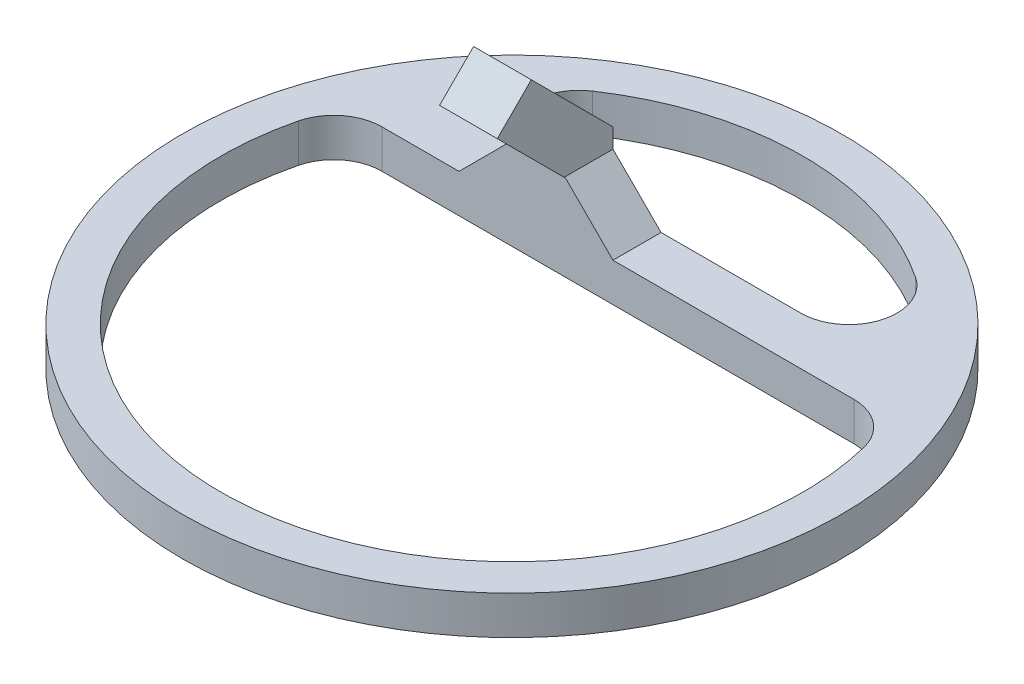
ISO-10303-21;
HEADER;
FILE_DESCRIPTION(('STEP AP214'),'2;1');
FILE_NAME('part.step','',(''),(''),'','','');
FILE_SCHEMA(('AUTOMOTIVE_DESIGN { 1 0 10303 214 1 1 1 1 }'));
ENDSEC;
DATA;
#1=APPLICATION_CONTEXT('core data for automotive mechanical design processes');
#2=APPLICATION_PROTOCOL_DEFINITION('international standard','automotive_design',2000,#1);
#3=PRODUCT_CONTEXT('',#1,'mechanical');
#4=PRODUCT('Part','Part','',(#3));
#5=PRODUCT_RELATED_PRODUCT_CATEGORY('part','',(#4));
#6=PRODUCT_DEFINITION_FORMATION('','',#4);
#7=PRODUCT_DEFINITION_CONTEXT('part definition',#1,'design');
#8=PRODUCT_DEFINITION('design','',#6,#7);
#9=PRODUCT_DEFINITION_SHAPE('','',#8);
#10=(LENGTH_UNIT() NAMED_UNIT(*) SI_UNIT(.MILLI.,.METRE.));
#11=(NAMED_UNIT(*) PLANE_ANGLE_UNIT() SI_UNIT($,.RADIAN.));
#12=(NAMED_UNIT(*) SI_UNIT($,.STERADIAN.) SOLID_ANGLE_UNIT());
#13=UNCERTAINTY_MEASURE_WITH_UNIT(LENGTH_MEASURE(1.E-05),#10,'distance_accuracy_value','');
#14=(GEOMETRIC_REPRESENTATION_CONTEXT(3) GLOBAL_UNCERTAINTY_ASSIGNED_CONTEXT((#13)) GLOBAL_UNIT_ASSIGNED_CONTEXT((#10,
#11,#12)) REPRESENTATION_CONTEXT('',''));
#15=CARTESIAN_POINT('',(0.,0.,0.));
#16=DIRECTION('',(0.,0.,1.));
#17=DIRECTION('',(1.,0.,0.));
#18=AXIS2_PLACEMENT_3D('',#15,#16,#17);
#19=CARTESIAN_POINT('',(0.,4.,0.));
#20=DIRECTION('',(0.,1.,0.));
#21=DIRECTION('',(0.,0.,1.));
#22=AXIS2_PLACEMENT_3D('',#19,#20,#21);
#23=PLANE('',#22);
#24=CARTESIAN_POINT('',(0.,4.,0.));
#25=DIRECTION('',(0.,1.,0.));
#26=DIRECTION('',(0.,0.,1.));
#27=AXIS2_PLACEMENT_3D('',#24,#25,#26);
#28=CIRCLE('',#27,34.25);
#29=CARTESIAN_POINT('',(0.,4.,34.25));
#30=VERTEX_POINT('',#29);
#31=EDGE_CURVE('E223',#30,#30,#28,.T.);
#32=ORIENTED_EDGE('',*,*,#31,.T.);
#33=EDGE_LOOP('',(#32));
#34=FACE_BOUND('',#33,.T.);
#35=DIRECTION('',(-1.,0.,0.));
#36=VECTOR('',#35,1.);
#37=CARTESIAN_POINT('',(28.1791146063889,4.,-11.));
#38=LINE('',#37,#36);
#39=CARTESIAN_POINT('',(-16.5,4.,-11.));
#40=VERTEX_POINT('',#39);
#41=CARTESIAN_POINT('',(-24.5267710879357,4.,-11.));
#42=VERTEX_POINT('',#41);
#43=EDGE_CURVE('E190',#40,#42,#38,.T.);
#44=ORIENTED_EDGE('',*,*,#43,.F.);
#45=DIRECTION('',(0.,0.,-1.));
#46=VECTOR('',#45,1.);
#47=CARTESIAN_POINT('',(-16.5,4.,0.));
#48=LINE('',#47,#46);
#49=CARTESIAN_POINT('',(-16.5,4.,-16.6583446172308));
#50=VERTEX_POINT('',#49);
#51=EDGE_CURVE('E60',#40,#50,#48,.T.);
#52=ORIENTED_EDGE('',*,*,#51,.T.);
#53=CARTESIAN_POINT('',(-14.02007489281,4.,-21.));
#54=DIRECTION('',(0.,1.,0.));
#55=DIRECTION('',(0.,0.,1.));
#56=AXIS2_PLACEMENT_3D('',#53,#54,#55);
#57=CIRCLE('',#56,5.);
#58=CARTESIAN_POINT('',(-16.7963273468317,4.,-25.1584158415841));
#59=VERTEX_POINT('',#58);
#60=EDGE_CURVE('E304',#50,#59,#57,.F.);
#61=ORIENTED_EDGE('',*,*,#60,.T.);
#62=CARTESIAN_POINT('',(0.,4.,0.));
#63=DIRECTION('',(0.,1.,0.));
#64=DIRECTION('',(0.,0.,1.));
#65=AXIS2_PLACEMENT_3D('',#62,#63,#64);
#66=CIRCLE('',#65,30.25);
#67=CARTESIAN_POINT('',(16.7963273468317,4.,-25.1584158415841));
#68=VERTEX_POINT('',#67);
#69=EDGE_CURVE('E219',#68,#59,#66,.T.);
#70=ORIENTED_EDGE('',*,*,#69,.F.);
#71=CARTESIAN_POINT('',(14.02007489281,4.,-21.));
#72=DIRECTION('',(0.,1.,0.));
#73=DIRECTION('',(0.,0.,1.));
#74=AXIS2_PLACEMENT_3D('',#71,#72,#73);
#75=CIRCLE('',#74,5.);
#76=CARTESIAN_POINT('',(14.02007489281,4.,-16.));
#77=VERTEX_POINT('',#76);
#78=EDGE_CURVE('E289',#68,#77,#75,.F.);
#79=ORIENTED_EDGE('',*,*,#78,.T.);
#80=DIRECTION('',(1.,0.,0.));
#81=VECTOR('',#80,1.);
#82=CARTESIAN_POINT('',(25.6722126042926,4.,-16.));
#83=LINE('',#82,#81);
#84=CARTESIAN_POINT('',(-0.500000000000021,4.,-16.));
#85=VERTEX_POINT('',#84);
#86=EDGE_CURVE('E209',#85,#77,#83,.T.);
#87=ORIENTED_EDGE('',*,*,#86,.F.);
#88=DIRECTION('',(0.,0.,1.));
#89=VECTOR('',#88,1.);
#90=CARTESIAN_POINT('',(-0.500000000000022,4.,-11.));
#91=LINE('',#90,#89);
#92=CARTESIAN_POINT('',(-0.500000000000021,4.,-11.));
#93=VERTEX_POINT('',#92);
#94=EDGE_CURVE('E227',#85,#93,#91,.T.);
#95=ORIENTED_EDGE('',*,*,#94,.T.);
#96=CARTESIAN_POINT('',(24.5267710879357,4.,-11.));
#97=VERTEX_POINT('',#96);
#98=EDGE_CURVE('E196',#97,#93,#38,.T.);
#99=ORIENTED_EDGE('',*,*,#98,.F.);
#100=CARTESIAN_POINT('',(24.5267710879357,4.,-6.00000000000001));
#101=DIRECTION('',(0.,1.,0.));
#102=DIRECTION('',(0.,0.,1.));
#103=AXIS2_PLACEMENT_3D('',#100,#101,#102);
#104=CIRCLE('',#103,5.);
#105=CARTESIAN_POINT('',(29.3835574419824,4.,-7.1881188118812));
#106=VERTEX_POINT('',#105);
#107=EDGE_CURVE('E295',#97,#106,#104,.F.);
#108=ORIENTED_EDGE('',*,*,#107,.T.);
#109=CARTESIAN_POINT('',(-29.3835574419824,4.,-7.1881188118812));
#110=VERTEX_POINT('',#109);
#111=EDGE_CURVE('E216',#110,#106,#66,.T.);
#112=ORIENTED_EDGE('',*,*,#111,.F.);
#113=CARTESIAN_POINT('',(-24.5267710879357,4.,-6.00000000000001));
#114=DIRECTION('',(0.,1.,0.));
#115=DIRECTION('',(0.,0.,1.));
#116=AXIS2_PLACEMENT_3D('',#113,#114,#115);
#117=CIRCLE('',#116,5.);
#118=EDGE_CURVE('E53',#110,#42,#117,.F.);
#119=ORIENTED_EDGE('',*,*,#118,.T.);
#120=EDGE_LOOP('',(#44,#52,#61,#70,#79,#87,#95,#99,#108,#112,#119));
#121=FACE_BOUND('',#120,.T.);
#122=ADVANCED_FACE('F44',(#34,#121),#23,.T.);
#123=CARTESIAN_POINT('',(0.,4.,0.));
#124=DIRECTION('',(0.,-1.,0.));
#125=DIRECTION('',(0.,0.,-1.));
#126=AXIS2_PLACEMENT_3D('',#123,#124,#125);
#127=CYLINDRICAL_SURFACE('',#126,30.25);
#128=CARTESIAN_POINT('',(0.,0.,0.));
#129=DIRECTION('',(0.,1.,0.));
#130=DIRECTION('',(0.,0.,1.));
#131=AXIS2_PLACEMENT_3D('',#128,#129,#130);
#132=CIRCLE('',#131,30.25);
#133=CARTESIAN_POINT('',(16.7963273468317,0.,-25.1584158415841));
#134=VERTEX_POINT('',#133);
#135=CARTESIAN_POINT('',(-16.7963273468317,0.,-25.1584158415841));
#136=VERTEX_POINT('',#135);
#137=EDGE_CURVE('E220',#134,#136,#132,.T.);
#138=ORIENTED_EDGE('',*,*,#137,.F.);
#139=DIRECTION('',(0.,-1.,0.));
#140=VECTOR('',#139,1.);
#141=CARTESIAN_POINT('',(16.7963273468317,4.,-25.1584158415842));
#142=LINE('',#141,#140);
#143=EDGE_CURVE('E265',#134,#68,#142,.F.);
#144=ORIENTED_EDGE('',*,*,#143,.T.);
#145=ORIENTED_EDGE('',*,*,#69,.T.);
#146=DIRECTION('',(0.,-1.,0.));
#147=VECTOR('',#146,1.);
#148=CARTESIAN_POINT('',(-16.7963273468317,4.,-25.1584158415842));
#149=LINE('',#148,#147);
#150=EDGE_CURVE('E262',#59,#136,#149,.T.);
#151=ORIENTED_EDGE('',*,*,#150,.T.);
#152=EDGE_LOOP('',(#138,#144,#145,#151));
#153=FACE_BOUND('',#152,.T.);
#154=ADVANCED_FACE('F348',(#153),#127,.F.);
#155=ORIENTED_EDGE('',*,*,#111,.T.);
#156=DIRECTION('',(0.,-1.,0.));
#157=VECTOR('',#156,1.);
#158=CARTESIAN_POINT('',(29.3835574419824,4.,-7.1881188118812));
#159=LINE('',#158,#157);
#160=CARTESIAN_POINT('',(29.3835574419824,0.,-7.1881188118812));
#161=VERTEX_POINT('',#160);
#162=EDGE_CURVE('E68',#106,#161,#159,.T.);
#163=ORIENTED_EDGE('',*,*,#162,.T.);
#164=CARTESIAN_POINT('',(-29.3835574419824,0.,-7.1881188118812));
#165=VERTEX_POINT('',#164);
#166=EDGE_CURVE('E205',#165,#161,#132,.T.);
#167=ORIENTED_EDGE('',*,*,#166,.F.);
#168=DIRECTION('',(0.,-1.,0.));
#169=VECTOR('',#168,1.);
#170=CARTESIAN_POINT('',(-29.3835574419824,4.,-7.1881188118812));
#171=LINE('',#170,#169);
#172=EDGE_CURVE('E283',#165,#110,#171,.F.);
#173=ORIENTED_EDGE('',*,*,#172,.T.);
#174=EDGE_LOOP('',(#155,#163,#167,#173));
#175=FACE_BOUND('',#174,.T.);
#176=ADVANCED_FACE('F322',(#175),#127,.F.);
#177=CARTESIAN_POINT('',(0.,0.,0.));
#178=DIRECTION('',(0.,1.,0.));
#179=DIRECTION('',(0.,0.,1.));
#180=AXIS2_PLACEMENT_3D('',#177,#178,#179);
#181=PLANE('',#180);
#182=DIRECTION('',(-1.,0.,0.));
#183=VECTOR('',#182,1.);
#184=CARTESIAN_POINT('',(25.6722126042926,0.,-16.));
#185=LINE('',#184,#183);
#186=CARTESIAN_POINT('',(14.02007489281,0.,-16.));
#187=VERTEX_POINT('',#186);
#188=CARTESIAN_POINT('',(-14.02007489281,0.,-16.));
#189=VERTEX_POINT('',#188);
#190=EDGE_CURVE('E206',#187,#189,#185,.T.);
#191=ORIENTED_EDGE('',*,*,#190,.F.);
#192=CARTESIAN_POINT('',(14.02007489281,0.,-21.));
#193=DIRECTION('',(0.,1.,0.));
#194=DIRECTION('',(0.,0.,1.));
#195=AXIS2_PLACEMENT_3D('',#192,#193,#194);
#196=CIRCLE('',#195,5.);
#197=EDGE_CURVE('E292',#187,#134,#196,.T.);
#198=ORIENTED_EDGE('',*,*,#197,.T.);
#199=ORIENTED_EDGE('',*,*,#137,.T.);
#200=CARTESIAN_POINT('',(-14.02007489281,0.,-21.));
#201=DIRECTION('',(0.,1.,0.));
#202=DIRECTION('',(0.,0.,1.));
#203=AXIS2_PLACEMENT_3D('',#200,#201,#202);
#204=CIRCLE('',#203,5.);
#205=EDGE_CURVE('E307',#136,#189,#204,.T.);
#206=ORIENTED_EDGE('',*,*,#205,.T.);
#207=EDGE_LOOP('',(#191,#198,#199,#206));
#208=FACE_BOUND('',#207,.T.);
#209=CARTESIAN_POINT('',(0.,0.,0.));
#210=DIRECTION('',(0.,1.,0.));
#211=DIRECTION('',(0.,0.,1.));
#212=AXIS2_PLACEMENT_3D('',#209,#210,#211);
#213=CIRCLE('',#212,34.25);
#214=CARTESIAN_POINT('',(0.,0.,34.25));
#215=VERTEX_POINT('',#214);
#216=EDGE_CURVE('E228',#215,#215,#213,.T.);
#217=ORIENTED_EDGE('',*,*,#216,.F.);
#218=EDGE_LOOP('',(#217));
#219=FACE_BOUND('',#218,.T.);
#220=DIRECTION('',(1.,0.,0.));
#221=VECTOR('',#220,1.);
#222=CARTESIAN_POINT('',(28.1791146063889,0.,-11.));
#223=LINE('',#222,#221);
#224=CARTESIAN_POINT('',(-24.5267710879357,0.,-11.));
#225=VERTEX_POINT('',#224);
#226=CARTESIAN_POINT('',(24.5267710879357,0.,-11.));
#227=VERTEX_POINT('',#226);
#228=EDGE_CURVE('E202',#225,#227,#223,.T.);
#229=ORIENTED_EDGE('',*,*,#228,.F.);
#230=CARTESIAN_POINT('',(-24.5267710879357,0.,-6.00000000000001));
#231=DIRECTION('',(0.,1.,0.));
#232=DIRECTION('',(0.,0.,1.));
#233=AXIS2_PLACEMENT_3D('',#230,#231,#232);
#234=CIRCLE('',#233,5.);
#235=EDGE_CURVE('E11',#225,#165,#234,.T.);
#236=ORIENTED_EDGE('',*,*,#235,.T.);
#237=ORIENTED_EDGE('',*,*,#166,.T.);
#238=CARTESIAN_POINT('',(24.5267710879357,0.,-6.00000000000001));
#239=DIRECTION('',(0.,1.,0.));
#240=DIRECTION('',(0.,0.,1.));
#241=AXIS2_PLACEMENT_3D('',#238,#239,#240);
#242=CIRCLE('',#241,5.);
#243=EDGE_CURVE('E298',#161,#227,#242,.T.);
#244=ORIENTED_EDGE('',*,*,#243,.T.);
#245=EDGE_LOOP('',(#229,#236,#237,#244));
#246=FACE_BOUND('',#245,.T.);
#247=ADVANCED_FACE('F320',(#208,#219,#246),#181,.F.);
#248=CARTESIAN_POINT('',(0.,4.,0.));
#249=DIRECTION('',(0.,-1.,0.));
#250=DIRECTION('',(0.,0.,-1.));
#251=AXIS2_PLACEMENT_3D('',#248,#249,#250);
#252=CYLINDRICAL_SURFACE('',#251,34.25);
#253=ORIENTED_EDGE('',*,*,#31,.F.);
#254=EDGE_LOOP('',(#253));
#255=FACE_BOUND('',#254,.T.);
#256=ORIENTED_EDGE('',*,*,#216,.T.);
#257=EDGE_LOOP('',(#256));
#258=FACE_BOUND('',#257,.T.);
#259=ADVANCED_FACE('F409',(#255,#258),#252,.T.);
#260=CARTESIAN_POINT('',(25.6722126042926,-56.5795899596312,-16.));
#261=DIRECTION('',(0.,0.,1.));
#262=DIRECTION('',(0.,-1.,0.));
#263=AXIS2_PLACEMENT_3D('',#260,#261,#262);
#264=PLANE('',#263);
#265=ORIENTED_EDGE('',*,*,#86,.T.);
#266=DIRECTION('',(0.,-1.,0.));
#267=VECTOR('',#266,1.);
#268=CARTESIAN_POINT('',(14.02007489281,-56.5795899596312,-16.));
#269=LINE('',#268,#267);
#270=EDGE_CURVE('E273',#77,#187,#269,.T.);
#271=ORIENTED_EDGE('',*,*,#270,.T.);
#272=ORIENTED_EDGE('',*,*,#190,.T.);
#273=DIRECTION('',(0.,-1.,0.));
#274=VECTOR('',#273,1.);
#275=CARTESIAN_POINT('',(-14.02007489281,-56.5795899596312,-16.));
#276=LINE('',#275,#274);
#277=CARTESIAN_POINT('',(-14.02007489281,6.47992510719005,-16.));
#278=VERTEX_POINT('',#277);
#279=EDGE_CURVE('E269',#189,#278,#276,.F.);
#280=ORIENTED_EDGE('',*,*,#279,.T.);
#281=DIRECTION('',(0.707106781186551,0.707106781186544,0.));
#282=VECTOR('',#281,1.);
#283=CARTESIAN_POINT('',(-25.7036886776691,-5.20368867766895,-16.));
#284=LINE('',#283,#282);
#285=CARTESIAN_POINT('',(-11.5,8.99999999999998,-16.));
#286=VERTEX_POINT('',#285);
#287=EDGE_CURVE('E243',#278,#286,#284,.T.);
#288=ORIENTED_EDGE('',*,*,#287,.T.);
#289=DIRECTION('',(0.,1.,0.));
#290=VECTOR('',#289,1.);
#291=CARTESIAN_POINT('',(-11.5,4.,-16.));
#292=LINE('',#291,#290);
#293=CARTESIAN_POINT('',(-11.5,11.,-16.));
#294=VERTEX_POINT('',#293);
#295=EDGE_CURVE('E368',#286,#294,#292,.T.);
#296=ORIENTED_EDGE('',*,*,#295,.T.);
#297=DIRECTION('',(-1.,0.,0.));
#298=VECTOR('',#297,1.);
#299=CARTESIAN_POINT('',(-5.5,11.,-16.));
#300=LINE('',#299,#298);
#301=CARTESIAN_POINT('',(-5.5,11.,-16.));
#302=VERTEX_POINT('',#301);
#303=EDGE_CURVE('E198',#302,#294,#300,.T.);
#304=ORIENTED_EDGE('',*,*,#303,.F.);
#305=DIRECTION('',(0.,1.,0.));
#306=VECTOR('',#305,1.);
#307=CARTESIAN_POINT('',(-5.5,4.,-16.));
#308=LINE('',#307,#306);
#309=CARTESIAN_POINT('',(-5.5,9.00000000000003,-16.));
#310=VERTEX_POINT('',#309);
#311=EDGE_CURVE('E173',#310,#302,#308,.T.);
#312=ORIENTED_EDGE('',*,*,#311,.F.);
#313=DIRECTION('',(-0.707106781186544,0.707106781186551,0.));
#314=VECTOR('',#313,1.);
#315=CARTESIAN_POINT('',(42.8759012819618,-39.3759012819622,-16.));
#316=LINE('',#315,#314);
#317=EDGE_CURVE('E253',#310,#85,#316,.F.);
#318=ORIENTED_EDGE('',*,*,#317,.T.);
#319=EDGE_LOOP('',(#265,#271,#272,#280,#288,#296,#304,#312,#318));
#320=FACE_BOUND('',#319,.T.);
#321=ADVANCED_FACE('F358',(#320),#264,.F.);
#322=CARTESIAN_POINT('',(28.1791146063889,-56.5795899596312,-11.));
#323=DIRECTION('',(0.,0.,-1.));
#324=DIRECTION('',(0.,1.,0.));
#325=AXIS2_PLACEMENT_3D('',#322,#323,#324);
#326=PLANE('',#325);
#327=ORIENTED_EDGE('',*,*,#228,.T.);
#328=DIRECTION('',(0.,-1.,0.));
#329=VECTOR('',#328,1.);
#330=CARTESIAN_POINT('',(24.5267710879357,-56.5795899596312,-11.));
#331=LINE('',#330,#329);
#332=EDGE_CURVE('E279',#227,#97,#331,.F.);
#333=ORIENTED_EDGE('',*,*,#332,.T.);
#334=ORIENTED_EDGE('',*,*,#98,.T.);
#335=DIRECTION('',(0.707106781186544,-0.707106781186551,0.));
#336=VECTOR('',#335,1.);
#337=CARTESIAN_POINT('',(44.1293522830099,-40.6293522830104,-11.));
#338=LINE('',#337,#336);
#339=CARTESIAN_POINT('',(-5.42893218813447,8.92893218813451,-11.));
#340=VERTEX_POINT('',#339);
#341=EDGE_CURVE('E256',#93,#340,#338,.F.);
#342=ORIENTED_EDGE('',*,*,#341,.T.);
#343=DIRECTION('',(-1.,0.,0.));
#344=VECTOR('',#343,1.);
#345=CARTESIAN_POINT('',(-5.5,8.92893218813451,-11.));
#346=LINE('',#345,#344);
#347=CARTESIAN_POINT('',(-11.5710678118655,8.92893218813451,-11.));
#348=VERTEX_POINT('',#347);
#349=EDGE_CURVE('E191',#340,#348,#346,.T.);
#350=ORIENTED_EDGE('',*,*,#349,.T.);
#351=DIRECTION('',(-0.707106781186551,-0.707106781186544,0.));
#352=VECTOR('',#351,1.);
#353=CARTESIAN_POINT('',(-24.4502376766209,-3.9502376766208,-11.));
#354=LINE('',#353,#352);
#355=EDGE_CURVE('E250',#348,#40,#354,.T.);
#356=ORIENTED_EDGE('',*,*,#355,.T.);
#357=ORIENTED_EDGE('',*,*,#43,.T.);
#358=DIRECTION('',(0.,-1.,0.));
#359=VECTOR('',#358,1.);
#360=CARTESIAN_POINT('',(-24.5267710879357,-56.5795899596312,-11.));
#361=LINE('',#360,#359);
#362=EDGE_CURVE('E276',#42,#225,#361,.T.);
#363=ORIENTED_EDGE('',*,*,#362,.T.);
#364=EDGE_LOOP('',(#327,#333,#334,#342,#350,#356,#357,#363));
#365=FACE_BOUND('',#364,.T.);
#366=ADVANCED_FACE('F315',(#365),#326,.F.);
#367=CARTESIAN_POINT('',(-5.5,19.4852813742386,-7.5147186257614));
#368=DIRECTION('',(0.,-0.707106781186546,-0.707106781186549));
#369=DIRECTION('',(0.,0.707106781186549,-0.707106781186546));
#370=AXIS2_PLACEMENT_3D('',#367,#368,#369);
#371=PLANE('',#370);
#372=DIRECTION('',(0.,-0.707106781186549,0.707106781186546));
#373=VECTOR('',#372,1.);
#374=CARTESIAN_POINT('',(-11.5,19.4852813742386,-7.5147186257614));
#375=LINE('',#374,#373);
#376=CARTESIAN_POINT('',(-11.5,19.4852813742386,-7.5147186257614));
#377=VERTEX_POINT('',#376);
#378=CARTESIAN_POINT('',(-11.5,15.9497474683058,-3.97918471982867));
#379=VERTEX_POINT('',#378);
#380=EDGE_CURVE('E188',#377,#379,#375,.T.);
#381=ORIENTED_EDGE('',*,*,#380,.T.);
#382=DIRECTION('',(-1.,0.,0.));
#383=VECTOR('',#382,1.);
#384=CARTESIAN_POINT('',(-5.5,15.9497474683058,-3.97918471982867));
#385=LINE('',#384,#383);
#386=CARTESIAN_POINT('',(-5.5,15.9497474683058,-3.97918471982867));
#387=VERTEX_POINT('',#386);
#388=EDGE_CURVE('E165',#387,#379,#385,.T.);
#389=ORIENTED_EDGE('',*,*,#388,.F.);
#390=DIRECTION('',(0.,-0.707106781186549,0.707106781186546));
#391=VECTOR('',#390,1.);
#392=CARTESIAN_POINT('',(-5.5,19.4852813742386,-7.5147186257614));
#393=LINE('',#392,#391);
#394=CARTESIAN_POINT('',(-5.5,19.4852813742386,-7.5147186257614));
#395=VERTEX_POINT('',#394);
#396=EDGE_CURVE('E174',#395,#387,#393,.T.);
#397=ORIENTED_EDGE('',*,*,#396,.F.);
#398=DIRECTION('',(-1.,0.,0.));
#399=VECTOR('',#398,1.);
#400=CARTESIAN_POINT('',(-5.5,19.4852813742386,-7.5147186257614));
#401=LINE('',#400,#399);
#402=EDGE_CURVE('E372',#395,#377,#401,.T.);
#403=ORIENTED_EDGE('',*,*,#402,.T.);
#404=EDGE_LOOP('',(#381,#389,#397,#403));
#405=FACE_BOUND('',#404,.T.);
#406=ADVANCED_FACE('F186',(#405),#371,.F.);
#407=CARTESIAN_POINT('',(-5.5,15.9497474683058,-3.97918471982867));
#408=DIRECTION('',(0.,0.707106781186549,-0.707106781186546));
#409=DIRECTION('',(0.,0.707106781186546,0.707106781186549));
#410=AXIS2_PLACEMENT_3D('',#407,#408,#409);
#411=PLANE('',#410);
#412=CARTESIAN_POINT('',(-8.49999999999997,13.1715728752538,-6.75735931288071));
#413=DIRECTION('',(0.,-0.707106781186549,0.707106781186546));
#414=DIRECTION('',(0.,-0.707106781186546,-0.707106781186549));
#415=AXIS2_PLACEMENT_3D('',#412,#413,#414);
#416=CIRCLE('',#415,1.65);
#417=CARTESIAN_POINT('',(-8.49999999999997,12.004846686296,-7.92408550183851));
#418=VERTEX_POINT('',#417);
#419=EDGE_CURVE('E439',#418,#418,#416,.T.);
#420=ORIENTED_EDGE('',*,*,#419,.F.);
#421=EDGE_LOOP('',(#420));
#422=FACE_BOUND('',#421,.T.);
#423=DIRECTION('',(0.,-0.707106781186546,-0.707106781186549));
#424=VECTOR('',#423,1.);
#425=CARTESIAN_POINT('',(-11.5,15.9497474683058,-3.97918471982867));
#426=LINE('',#425,#424);
#427=CARTESIAN_POINT('',(-11.5,8.99999999999997,-10.9289321881345));
#428=VERTEX_POINT('',#427);
#429=EDGE_CURVE('E333',#379,#428,#426,.T.);
#430=ORIENTED_EDGE('',*,*,#429,.T.);
#431=DIRECTION('',(-0.577350269189629,-0.577350269189623,-0.577350269189625));
#432=VECTOR('',#431,1.);
#433=CARTESIAN_POINT('',(-4.8668350211294,15.6331649788705,-4.29576720926398));
#434=LINE('',#433,#432);
#435=EDGE_CURVE('E246',#428,#348,#434,.T.);
#436=ORIENTED_EDGE('',*,*,#435,.T.);
#437=ORIENTED_EDGE('',*,*,#349,.F.);
#438=DIRECTION('',(0.577350269189621,-0.577350269189627,-0.577350269189629));
#439=VECTOR('',#438,1.);
#440=CARTESIAN_POINT('',(-10.1331649788705,13.6331649788706,-6.2957672092639));
#441=LINE('',#440,#439);
#442=CARTESIAN_POINT('',(-5.5,9.00000000000003,-10.9289321881345));
#443=VERTEX_POINT('',#442);
#444=EDGE_CURVE('E168',#340,#443,#441,.F.);
#445=ORIENTED_EDGE('',*,*,#444,.T.);
#446=DIRECTION('',(0.,-0.707106781186546,-0.707106781186549));
#447=VECTOR('',#446,1.);
#448=CARTESIAN_POINT('',(-5.5,15.9497474683058,-3.97918471982867));
#449=LINE('',#448,#447);
#450=EDGE_CURVE('E160',#387,#443,#449,.T.);
#451=ORIENTED_EDGE('',*,*,#450,.F.);
#452=ORIENTED_EDGE('',*,*,#388,.T.);
#453=EDGE_LOOP('',(#430,#436,#437,#445,#451,#452));
#454=FACE_BOUND('',#453,.T.);
#455=ADVANCED_FACE('F163',(#422,#454),#411,.F.);
#456=CARTESIAN_POINT('',(-5.5,11.,-16.));
#457=DIRECTION('',(0.,-0.707106781186549,0.707106781186546));
#458=DIRECTION('',(0.,-0.707106781186546,-0.707106781186549));
#459=AXIS2_PLACEMENT_3D('',#456,#457,#458);
#460=PLANE('',#459);
#461=CARTESIAN_POINT('',(-8.49999999999997,16.7071067811865,-10.2928932188134));
#462=DIRECTION('',(0.,-0.707106781186549,0.707106781186546));
#463=DIRECTION('',(0.,-0.707106781186546,-0.707106781186549));
#464=AXIS2_PLACEMENT_3D('',#461,#462,#463);
#465=CIRCLE('',#464,1.65);
#466=CARTESIAN_POINT('',(-8.49999999999997,15.5403805922287,-11.4596194077712));
#467=VERTEX_POINT('',#466);
#468=EDGE_CURVE('E381',#467,#467,#465,.F.);
#469=ORIENTED_EDGE('',*,*,#468,.F.);
#470=EDGE_LOOP('',(#469));
#471=FACE_BOUND('',#470,.T.);
#472=DIRECTION('',(0.,0.707106781186546,0.707106781186549));
#473=VECTOR('',#472,1.);
#474=CARTESIAN_POINT('',(-11.5,11.,-16.));
#475=LINE('',#474,#473);
#476=EDGE_CURVE('E184',#294,#377,#475,.T.);
#477=ORIENTED_EDGE('',*,*,#476,.T.);
#478=ORIENTED_EDGE('',*,*,#402,.F.);
#479=DIRECTION('',(0.,0.707106781186546,0.707106781186549));
#480=VECTOR('',#479,1.);
#481=CARTESIAN_POINT('',(-5.5,11.,-16.));
#482=LINE('',#481,#480);
#483=EDGE_CURVE('E179',#302,#395,#482,.T.);
#484=ORIENTED_EDGE('',*,*,#483,.F.);
#485=ORIENTED_EDGE('',*,*,#303,.T.);
#486=EDGE_LOOP('',(#477,#478,#484,#485));
#487=FACE_BOUND('',#486,.T.);
#488=ADVANCED_FACE('F373',(#471,#487),#460,.F.);
#489=CARTESIAN_POINT('',(-5.5,0.,0.));
#490=DIRECTION('',(1.,0.,0.));
#491=DIRECTION('',(0.,0.,-1.));
#492=AXIS2_PLACEMENT_3D('',#489,#490,#491);
#493=PLANE('',#492);
#494=ORIENTED_EDGE('',*,*,#450,.T.);
#495=DIRECTION('',(0.,0.,-1.));
#496=VECTOR('',#495,1.);
#497=CARTESIAN_POINT('',(-5.5,9.00000000000003,-16.));
#498=LINE('',#497,#496);
#499=EDGE_CURVE('E240',#443,#310,#498,.T.);
#500=ORIENTED_EDGE('',*,*,#499,.T.);
#501=ORIENTED_EDGE('',*,*,#311,.T.);
#502=ORIENTED_EDGE('',*,*,#483,.T.);
#503=ORIENTED_EDGE('',*,*,#396,.T.);
#504=EDGE_LOOP('',(#494,#500,#501,#502,#503));
#505=FACE_BOUND('',#504,.T.);
#506=ADVANCED_FACE('F177',(#505),#493,.T.);
#507=CARTESIAN_POINT('',(-11.5,0.,0.));
#508=DIRECTION('',(1.,0.,0.));
#509=DIRECTION('',(0.,0.,-1.));
#510=AXIS2_PLACEMENT_3D('',#507,#508,#509);
#511=PLANE('',#510);
#512=ORIENTED_EDGE('',*,*,#295,.F.);
#513=DIRECTION('',(0.,0.,1.));
#514=VECTOR('',#513,1.);
#515=CARTESIAN_POINT('',(-11.5,8.99999999999998,0.));
#516=LINE('',#515,#514);
#517=EDGE_CURVE('E237',#286,#428,#516,.T.);
#518=ORIENTED_EDGE('',*,*,#517,.T.);
#519=ORIENTED_EDGE('',*,*,#429,.F.);
#520=ORIENTED_EDGE('',*,*,#380,.F.);
#521=ORIENTED_EDGE('',*,*,#476,.F.);
#522=EDGE_LOOP('',(#512,#518,#519,#520,#521));
#523=FACE_BOUND('',#522,.T.);
#524=ADVANCED_FACE('F388',(#523),#511,.F.);
#525=CARTESIAN_POINT('',(-16.5,4.,0.));
#526=DIRECTION('',(0.707106781186544,-0.707106781186551,0.));
#527=DIRECTION('',(0.,0.,-1.));
#528=AXIS2_PLACEMENT_3D('',#525,#526,#527);
#529=PLANE('',#528);
#530=ORIENTED_EDGE('',*,*,#435,.F.);
#531=ORIENTED_EDGE('',*,*,#517,.F.);
#532=ORIENTED_EDGE('',*,*,#287,.F.);
#533=CARTESIAN_POINT('',(-14.02007489281,6.47992510719004,-21.));
#534=DIRECTION('',(0.707106781186544,-0.707106781186551,0.));
#535=DIRECTION('',(-0.707106781186551,-0.707106781186544,0.));
#536=AXIS2_PLACEMENT_3D('',#533,#534,#535);
#537=ELLIPSE('',#536,7.07106781186544,5.);
#538=EDGE_CURVE('E301',#278,#50,#537,.T.);
#539=ORIENTED_EDGE('',*,*,#538,.T.);
#540=ORIENTED_EDGE('',*,*,#51,.F.);
#541=ORIENTED_EDGE('',*,*,#355,.F.);
#542=EDGE_LOOP('',(#530,#531,#532,#539,#540,#541));
#543=FACE_BOUND('',#542,.T.);
#544=ADVANCED_FACE('F336',(#543),#529,.F.);
#545=CARTESIAN_POINT('',(-5.5,9.00000000000003,0.));
#546=DIRECTION('',(0.707106781186551,0.707106781186544,0.));
#547=DIRECTION('',(0.,0.,1.));
#548=AXIS2_PLACEMENT_3D('',#545,#546,#547);
#549=PLANE('',#548);
#550=ORIENTED_EDGE('',*,*,#341,.F.);
#551=ORIENTED_EDGE('',*,*,#94,.F.);
#552=ORIENTED_EDGE('',*,*,#317,.F.);
#553=ORIENTED_EDGE('',*,*,#499,.F.);
#554=ORIENTED_EDGE('',*,*,#444,.F.);
#555=EDGE_LOOP('',(#550,#551,#552,#553,#554));
#556=FACE_BOUND('',#555,.T.);
#557=ADVANCED_FACE('F331',(#556),#549,.T.);
#558=CARTESIAN_POINT('',(14.02007489281,4.,-21.));
#559=DIRECTION('',(0.,-1.,0.));
#560=DIRECTION('',(0.,0.,-1.));
#561=AXIS2_PLACEMENT_3D('',#558,#559,#560);
#562=CYLINDRICAL_SURFACE('',#561,5.);
#563=ORIENTED_EDGE('',*,*,#197,.F.);
#564=ORIENTED_EDGE('',*,*,#270,.F.);
#565=ORIENTED_EDGE('',*,*,#78,.F.);
#566=ORIENTED_EDGE('',*,*,#143,.F.);
#567=EDGE_LOOP('',(#563,#564,#565,#566));
#568=FACE_BOUND('',#567,.T.);
#569=ADVANCED_FACE('F362',(#568),#562,.F.);
#570=CARTESIAN_POINT('',(24.5267710879357,4.,-6.00000000000001));
#571=DIRECTION('',(0.,-1.,0.));
#572=DIRECTION('',(0.,0.,-1.));
#573=AXIS2_PLACEMENT_3D('',#570,#571,#572);
#574=CYLINDRICAL_SURFACE('',#573,5.);
#575=ORIENTED_EDGE('',*,*,#243,.F.);
#576=ORIENTED_EDGE('',*,*,#162,.F.);
#577=ORIENTED_EDGE('',*,*,#107,.F.);
#578=ORIENTED_EDGE('',*,*,#332,.F.);
#579=EDGE_LOOP('',(#575,#576,#577,#578));
#580=FACE_BOUND('',#579,.T.);
#581=ADVANCED_FACE('F324',(#580),#574,.F.);
#582=CARTESIAN_POINT('',(-14.02007489281,4.,-21.));
#583=DIRECTION('',(0.,-1.,0.));
#584=DIRECTION('',(0.,0.,-1.));
#585=AXIS2_PLACEMENT_3D('',#582,#583,#584);
#586=CYLINDRICAL_SURFACE('',#585,5.);
#587=ORIENTED_EDGE('',*,*,#205,.F.);
#588=ORIENTED_EDGE('',*,*,#150,.F.);
#589=ORIENTED_EDGE('',*,*,#60,.F.);
#590=ORIENTED_EDGE('',*,*,#538,.F.);
#591=ORIENTED_EDGE('',*,*,#279,.F.);
#592=EDGE_LOOP('',(#587,#588,#589,#590,#591));
#593=FACE_BOUND('',#592,.T.);
#594=ADVANCED_FACE('F343',(#593),#586,.F.);
#595=CARTESIAN_POINT('',(-24.5267710879357,4.,-6.00000000000001));
#596=DIRECTION('',(0.,-1.,0.));
#597=DIRECTION('',(0.,0.,-1.));
#598=AXIS2_PLACEMENT_3D('',#595,#596,#597);
#599=CYLINDRICAL_SURFACE('',#598,5.);
#600=ORIENTED_EDGE('',*,*,#235,.F.);
#601=ORIENTED_EDGE('',*,*,#362,.F.);
#602=ORIENTED_EDGE('',*,*,#118,.F.);
#603=ORIENTED_EDGE('',*,*,#172,.F.);
#604=EDGE_LOOP('',(#600,#601,#602,#603));
#605=FACE_BOUND('',#604,.T.);
#606=ADVANCED_FACE('F46',(#605),#599,.F.);
#607=CARTESIAN_POINT('',(-8.49999999999997,30.0757474683058,-23.6615339059327));
#608=DIRECTION('',(0.,-0.707106781186549,0.707106781186546));
#609=DIRECTION('',(0.,-0.707106781186546,-0.707106781186549));
#610=AXIS2_PLACEMENT_3D('',#607,#608,#609);
#611=CYLINDRICAL_SURFACE('',#610,1.65);
#612=CARTESIAN_POINT('',(-8.49999999999997,12.004846686296,-7.92408550183851));
#613=CARTESIAN_POINT('',(-8.49999999999997,12.0416751644828,-7.96091398002531));
#614=CARTESIAN_POINT('',(-8.49999999999997,12.0785036426696,-7.99774245821211));
#615=CARTESIAN_POINT('',(-8.49999999999997,12.1521605990432,-8.07139941458571));
#616=CARTESIAN_POINT('',(-8.49999999999997,12.18898907723,-8.10822789277251));
#617=CARTESIAN_POINT('',(-8.49999999999997,12.2626460336036,-8.18188484914611));
#618=CARTESIAN_POINT('',(-8.49999999999997,12.2994745117904,-8.21871332733291));
#619=CARTESIAN_POINT('',(-8.49999999999997,12.373131468164,-8.29237028370651));
#620=CARTESIAN_POINT('',(-8.49999999999997,12.4099599463508,-8.32919876189331));
#621=CARTESIAN_POINT('',(-8.49999999999997,12.4836169027244,-8.40285571826691));
#622=CARTESIAN_POINT('',(-8.49999999999997,12.5204453809112,-8.43968419645371));
#623=CARTESIAN_POINT('',(-8.49999999999997,12.5941023372848,-8.5133411528273));
#624=CARTESIAN_POINT('',(-8.49999999999997,12.6309308154716,-8.5501696310141));
#625=CARTESIAN_POINT('',(-8.49999999999997,12.7045877718452,-8.6238265873877));
#626=CARTESIAN_POINT('',(-8.49999999999997,12.741416250032,-8.6606550655745));
#627=CARTESIAN_POINT('',(-8.49999999999997,12.8150732064056,-8.7343120219481));
#628=CARTESIAN_POINT('',(-8.49999999999997,12.8519016845924,-8.7711405001349));
#629=CARTESIAN_POINT('',(-8.49999999999997,12.925558640966,-8.84479745650849));
#630=CARTESIAN_POINT('',(-8.49999999999997,12.9623871191528,-8.88162593469529));
#631=CARTESIAN_POINT('',(-8.49999999999997,13.0360440755264,-8.95528289106889));
#632=CARTESIAN_POINT('',(-8.49999999999997,13.0728725537132,-8.99211136925569));
#633=CARTESIAN_POINT('',(-8.49999999999997,13.1465295100868,-9.06576832562929));
#634=CARTESIAN_POINT('',(-8.49999999999997,13.1833579882736,-9.10259680381609));
#635=CARTESIAN_POINT('',(-8.49999999999997,13.2570149446472,-9.17625376018969));
#636=CARTESIAN_POINT('',(-8.49999999999997,13.293843422834,-9.21308223837649));
#637=CARTESIAN_POINT('',(-8.49999999999997,13.3675003792076,-9.28673919475009));
#638=CARTESIAN_POINT('',(-8.49999999999997,13.4043288573944,-9.32356767293689));
#639=CARTESIAN_POINT('',(-8.49999999999997,13.477985813768,-9.39722462931048));
#640=CARTESIAN_POINT('',(-8.49999999999997,13.5148142919548,-9.43405310749728));
#641=CARTESIAN_POINT('',(-8.49999999999997,13.5884712483284,-9.50771006387088));
#642=CARTESIAN_POINT('',(-8.49999999999997,13.6252997265152,-9.54453854205768));
#643=CARTESIAN_POINT('',(-8.49999999999997,13.6989566828888,-9.61819549843128));
#644=CARTESIAN_POINT('',(-8.49999999999997,13.7357851610756,-9.65502397661808));
#645=CARTESIAN_POINT('',(-8.49999999999997,13.8094421174492,-9.72868093299168));
#646=CARTESIAN_POINT('',(-8.49999999999997,13.846270595636,-9.76550941117848));
#647=CARTESIAN_POINT('',(-8.49999999999997,13.9199275520096,-9.83916636755207));
#648=CARTESIAN_POINT('',(-8.49999999999997,13.9567560301964,-9.87599484573887));
#649=CARTESIAN_POINT('',(-8.49999999999997,14.03041298657,-9.94965180211247));
#650=CARTESIAN_POINT('',(-8.49999999999997,14.0672414647568,-9.98648028029927));
#651=CARTESIAN_POINT('',(-8.49999999999997,14.1408984211304,-10.0601372366729));
#652=CARTESIAN_POINT('',(-8.49999999999997,14.1777268993172,-10.0969657148597));
#653=CARTESIAN_POINT('',(-8.49999999999997,14.2513838556908,-10.1706226712333));
#654=CARTESIAN_POINT('',(-8.49999999999997,14.2882123338776,-10.2074511494201));
#655=CARTESIAN_POINT('',(-8.49999999999997,14.3618692902512,-10.2811081057937));
#656=CARTESIAN_POINT('',(-8.49999999999997,14.398697768438,-10.3179365839805));
#657=CARTESIAN_POINT('',(-8.49999999999997,14.4723547248115,-10.3915935403541));
#658=CARTESIAN_POINT('',(-8.49999999999997,14.5091832029983,-10.4284220185409));
#659=CARTESIAN_POINT('',(-8.49999999999997,14.5828401593719,-10.5020789749145));
#660=CARTESIAN_POINT('',(-8.49999999999997,14.6196686375587,-10.5389074531013));
#661=CARTESIAN_POINT('',(-8.49999999999997,14.6933255939323,-10.6125644094749));
#662=CARTESIAN_POINT('',(-8.49999999999997,14.7301540721191,-10.6493928876617));
#663=CARTESIAN_POINT('',(-8.49999999999997,14.8038110284927,-10.7230498440353));
#664=CARTESIAN_POINT('',(-8.49999999999997,14.8406395066795,-10.7598783222221));
#665=CARTESIAN_POINT('',(-8.49999999999997,14.9142964630531,-10.8335352785957));
#666=CARTESIAN_POINT('',(-8.49999999999997,14.9511249412399,-10.8703637567825));
#667=CARTESIAN_POINT('',(-8.49999999999997,15.0247818976135,-10.9440207131561));
#668=CARTESIAN_POINT('',(-8.49999999999997,15.0616103758003,-10.9808491913429));
#669=CARTESIAN_POINT('',(-8.49999999999997,15.1352673321739,-11.0545061477165));
#670=CARTESIAN_POINT('',(-8.49999999999997,15.1720958103607,-11.0913346259033));
#671=CARTESIAN_POINT('',(-8.49999999999997,15.2457527667343,-11.1649915822768));
#672=CARTESIAN_POINT('',(-8.49999999999997,15.2825812449211,-11.2018200604636));
#673=CARTESIAN_POINT('',(-8.49999999999997,15.3562382012947,-11.2754770168372));
#674=CARTESIAN_POINT('',(-8.49999999999997,15.3930666794815,-11.312305495024));
#675=CARTESIAN_POINT('',(-8.49999999999997,15.4667236358551,-11.3859624513976));
#676=CARTESIAN_POINT('',(-8.49999999999997,15.5035521140419,-11.4227909295844));
#677=CARTESIAN_POINT('',(-8.49999999999997,15.5403805922287,-11.4596194077712));
#678=B_SPLINE_CURVE_WITH_KNOTS('',3,(#612,#613,#614,#615,#616,#617,#618,#619,#620,#621,#622,
#623,#624,#625,#626,#627,#628,#629,#630,#631,#632,#633,#634,#635,#636,#637,#638,#639,#640,#641,
#642,#643,#644,#645,#646,#647,#648,#649,#650,#651,#652,#653,#654,#655,#656,#657,#658,#659,#660,
#661,#662,#663,#664,#665,#666,#667,#668,#669,#670,#671,#672,#673,#674,#675,#676,#677),
.UNSPECIFIED.,.F.,.F.,(4,2,2,2,2,2,2,2,2,2,2,2,2,2,2,2,2,2,2,2,2,2,2,2,2,2,2,2,2,2,2,2,4),(0.,
0.156250000000001,0.312500000000001,0.468750000000002,0.625000000000003,0.781250000000003,
0.937500000000002,1.09375,1.25,1.40625,1.5625,1.71875,1.875,2.03125,2.1875,2.34375,2.5,2.65625,
2.8125,2.96875,3.125,3.28125,3.4375,3.59375,3.75,3.90625,4.0625,4.21875,4.375,4.53125,4.6875,
4.84375,5.),.UNSPECIFIED.);
#679=EDGE_CURVE('BSEAM428',#418,#467,#678,.T.);
#680=ORIENTED_EDGE('',*,*,#419,.T.);
#681=ORIENTED_EDGE('',*,*,#468,.T.);
#682=ORIENTED_EDGE('',*,*,#679,.T.);
#683=ORIENTED_EDGE('',*,*,#679,.F.);
#684=EDGE_LOOP('',(#680,#682,#681,#683));
#685=FACE_BOUND('',#684,.T.);
#686=ADVANCED_FACE('F428',(#685),#611,.F.);
#687=CLOSED_SHELL('',(#122,#154,#176,#247,#259,#321,#366,#406,#455,#488,#506,#524,#544,#557,
#569,#581,#594,#606,#686));
#688=MANIFOLD_SOLID_BREP('B2',#687);
#689=ADVANCED_BREP_SHAPE_REPRESENTATION('',(#18,#688),#14);
#690=SHAPE_DEFINITION_REPRESENTATION(#9,#689);
ENDSEC;
END-ISO-10303-21;
